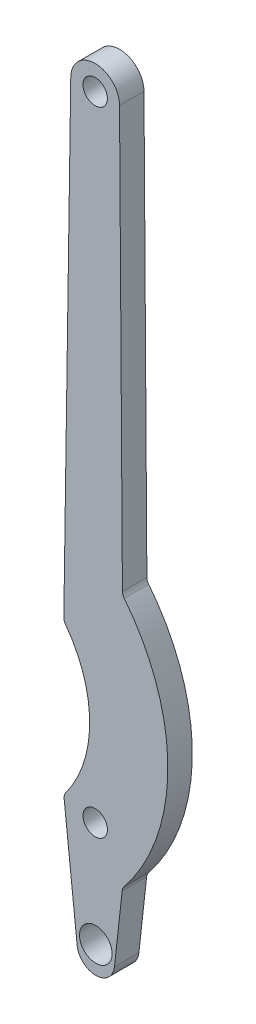
ISO-10303-21;
HEADER;
FILE_DESCRIPTION(('STEP AP214'),'2;1');
FILE_NAME('part.step','',(''),(''),'','','');
FILE_SCHEMA(('AUTOMOTIVE_DESIGN { 1 0 10303 214 1 1 1 1 }'));
ENDSEC;
DATA;
#1=APPLICATION_CONTEXT('core data for automotive mechanical design processes');
#2=APPLICATION_PROTOCOL_DEFINITION('international standard','automotive_design',2000,#1);
#3=PRODUCT_CONTEXT('',#1,'mechanical');
#4=PRODUCT('Part','Part','',(#3));
#5=PRODUCT_RELATED_PRODUCT_CATEGORY('part','',(#4));
#6=PRODUCT_DEFINITION_FORMATION('','',#4);
#7=PRODUCT_DEFINITION_CONTEXT('part definition',#1,'design');
#8=PRODUCT_DEFINITION('design','',#6,#7);
#9=PRODUCT_DEFINITION_SHAPE('','',#8);
#10=(LENGTH_UNIT() NAMED_UNIT(*) SI_UNIT(.MILLI.,.METRE.));
#11=(NAMED_UNIT(*) PLANE_ANGLE_UNIT() SI_UNIT($,.RADIAN.));
#12=(NAMED_UNIT(*) SI_UNIT($,.STERADIAN.) SOLID_ANGLE_UNIT());
#13=UNCERTAINTY_MEASURE_WITH_UNIT(LENGTH_MEASURE(1.E-05),#10,'distance_accuracy_value','');
#14=(GEOMETRIC_REPRESENTATION_CONTEXT(3) GLOBAL_UNCERTAINTY_ASSIGNED_CONTEXT((#13)) GLOBAL_UNIT_ASSIGNED_CONTEXT((#10,
#11,#12)) REPRESENTATION_CONTEXT('',''));
#15=CARTESIAN_POINT('',(0.,0.,0.));
#16=DIRECTION('',(0.,0.,1.));
#17=DIRECTION('',(1.,0.,0.));
#18=AXIS2_PLACEMENT_3D('',#15,#16,#17);
#19=CARTESIAN_POINT('',(-2.88963160667249,14.6637788753765,3.));
#20=DIRECTION('',(0.,0.,1.));
#21=DIRECTION('',(1.,0.,0.));
#22=AXIS2_PLACEMENT_3D('',#19,#20,#21);
#23=PLANE('',#22);
#24=CARTESIAN_POINT('',(-0.073800570580815,13.899599644221,3.));
#25=DIRECTION('',(0.,0.,1.));
#26=DIRECTION('',(1.,0.,0.));
#27=AXIS2_PLACEMENT_3D('',#24,#25,#26);
#28=CIRCLE('',#27,1.5);
#29=CARTESIAN_POINT('',(1.42619942941919,13.899599644221,3.));
#30=VERTEX_POINT('',#29);
#31=EDGE_CURVE('E288',#30,#30,#28,.T.);
#32=ORIENTED_EDGE('',*,*,#31,.F.);
#33=EDGE_LOOP('',(#32));
#34=FACE_BOUND('',#33,.T.);
#35=CARTESIAN_POINT('',(-2.88963160667249,14.6637788753765,3.));
#36=DIRECTION('',(0.,0.,1.));
#37=DIRECTION('',(1.,0.,0.));
#38=AXIS2_PLACEMENT_3D('',#35,#36,#37);
#39=CIRCLE('',#38,1.);
#40=CARTESIAN_POINT('',(-3.69322801783849,15.2589534782967,3.));
#41=VERTEX_POINT('',#40);
#42=CARTESIAN_POINT('',(-3.88386171590872,14.5565105674375,3.));
#43=VERTEX_POINT('',#42);
#44=EDGE_CURVE('E179',#41,#43,#39,.T.);
#45=ORIENTED_EDGE('',*,*,#44,.T.);
#46=DIRECTION('',(0.107268307939079,-0.994230109236231,0.));
#47=VECTOR('',#46,1.);
#48=CARTESIAN_POINT('',(-2.28672925124333,-0.246717108259881,3.));
#49=LINE('',#48,#47);
#50=CARTESIAN_POINT('',(-2.28672925124333,-0.246717108259881,3.));
#51=VERTEX_POINT('',#50);
#52=EDGE_CURVE('E107',#43,#51,#49,.T.);
#53=ORIENTED_EDGE('',*,*,#52,.T.);
#54=CARTESIAN_POINT('',(0.,0.,3.));
#55=DIRECTION('',(0.,0.,1.));
#56=DIRECTION('',(1.,0.,0.));
#57=AXIS2_PLACEMENT_3D('',#54,#55,#56);
#58=CIRCLE('',#57,2.3);
#59=CARTESIAN_POINT('',(2.28593295862145,-0.253989190101071,3.));
#60=VERTEX_POINT('',#59);
#61=EDGE_CURVE('E206',#51,#60,#58,.T.);
#62=ORIENTED_EDGE('',*,*,#61,.T.);
#63=DIRECTION('',(0.11043008265264,0.993883895052803,0.));
#64=VECTOR('',#63,1.);
#65=CARTESIAN_POINT('',(2.28593295862145,-0.253989190101071,3.));
#66=LINE('',#65,#64);
#67=CARTESIAN_POINT('',(3.23718165237959,8.30736233845027,3.));
#68=VERTEX_POINT('',#67);
#69=EDGE_CURVE('E225',#60,#68,#66,.T.);
#70=ORIENTED_EDGE('',*,*,#69,.T.);
#71=CARTESIAN_POINT('',(4.23106554743239,8.19693225579763,3.));
#72=DIRECTION('',(0.,0.,-1.));
#73=DIRECTION('',(1.,0.,0.));
#74=AXIS2_PLACEMENT_3D('',#71,#72,#73);
#75=CIRCLE('',#74,1.00000000000001);
#76=CARTESIAN_POINT('',(3.45033112153779,8.82179524575865,3.));
#77=VERTEX_POINT('',#76);
#78=EDGE_CURVE('E222',#68,#77,#75,.T.);
#79=ORIENTED_EDGE('',*,*,#78,.T.);
#80=CARTESIAN_POINT('',(-15.7471741853285,24.1865725220985,3.));
#81=DIRECTION('',(0.,0.,1.));
#82=DIRECTION('',(1.,0.,0.));
#83=AXIS2_PLACEMENT_3D('',#80,#81,#82);
#84=CIRCLE('',#83,24.5890339533437);
#85=CARTESIAN_POINT('',(3.48495827881477,39.5079847168125,3.));
#86=VERTEX_POINT('',#85);
#87=EDGE_CURVE('E224',#77,#86,#84,.T.);
#88=ORIENTED_EDGE('',*,*,#87,.T.);
#89=CARTESIAN_POINT('',(4.26710094048401,40.1310841124125,3.));
#90=DIRECTION('',(0.,0.,-1.));
#91=DIRECTION('',(1.,0.,0.));
#92=AXIS2_PLACEMENT_3D('',#89,#90,#91);
#93=CIRCLE('',#92,1.00000000000001);
#94=CARTESIAN_POINT('',(3.26712479890989,40.1241764150708,3.));
#95=VERTEX_POINT('',#94);
#96=EDGE_CURVE('E227',#86,#95,#93,.T.);
#97=ORIENTED_EDGE('',*,*,#96,.T.);
#98=DIRECTION('',(-0.00690769734163375,0.999976141574106,0.));
#99=VECTOR('',#98,1.);
#100=CARTESIAN_POINT('',(3.26712479890989,40.1241764150708,3.));
#101=LINE('',#100,#99);
#102=CARTESIAN_POINT('',(2.91166537517463,91.5814023839316,3.));
#103=VERTEX_POINT('',#102);
#104=EDGE_CURVE('E233',#95,#103,#101,.T.);
#105=ORIENTED_EDGE('',*,*,#104,.T.);
#106=CARTESIAN_POINT('',(-0.0791194399048102,91.5607424547017,3.));
#107=DIRECTION('',(0.,0.,1.));
#108=DIRECTION('',(1.,0.,0.));
#109=AXIS2_PLACEMENT_3D('',#106,#107,#108);
#110=CIRCLE('',#109,2.99085617219978);
#111=CARTESIAN_POINT('',(-3.06965130583689,91.6047856338595,3.));
#112=VERTEX_POINT('',#111);
#113=EDGE_CURVE('E138',#103,#112,#110,.T.);
#114=ORIENTED_EDGE('',*,*,#113,.T.);
#115=DIRECTION('',(-0.0147259435499138,-0.99989156741447,0.));
#116=VECTOR('',#115,1.);
#117=CARTESIAN_POINT('',(-3.92145874370195,33.7670605811119,3.));
#118=LINE('',#117,#116);
#119=CARTESIAN_POINT('',(-3.92145874370195,33.7670605811119,3.));
#120=VERTEX_POINT('',#119);
#121=EDGE_CURVE('E132',#112,#120,#118,.T.);
#122=ORIENTED_EDGE('',*,*,#121,.T.);
#123=CARTESIAN_POINT('',(-2.92156717628748,33.752334637562,3.));
#124=DIRECTION('',(0.,0.,1.));
#125=DIRECTION('',(1.,0.,0.));
#126=AXIS2_PLACEMENT_3D('',#123,#124,#125);
#127=CIRCLE('',#126,1.);
#128=CARTESIAN_POINT('',(-3.72316761435255,33.1544745053455,3.));
#129=VERTEX_POINT('',#128);
#130=EDGE_CURVE('E136',#120,#129,#127,.T.);
#131=ORIENTED_EDGE('',*,*,#130,.T.);
#132=CARTESIAN_POINT('',(-15.7471741853285,24.1865725220985,3.));
#133=DIRECTION('',(0.,0.,-1.));
#134=DIRECTION('',(1.,0.,0.));
#135=AXIS2_PLACEMENT_3D('',#132,#133,#134);
#136=CIRCLE('',#135,15.);
#137=EDGE_CURVE('E52',#129,#41,#136,.T.);
#138=ORIENTED_EDGE('',*,*,#137,.T.);
#139=EDGE_LOOP('',(#45,#53,#62,#70,#79,#88,#97,#105,#114,#122,#131,#138));
#140=FACE_BOUND('',#139,.T.);
#141=CARTESIAN_POINT('',(-0.0791194399048102,91.5607424547017,3.));
#142=DIRECTION('',(0.,0.,1.));
#143=DIRECTION('',(1.,0.,0.));
#144=AXIS2_PLACEMENT_3D('',#141,#142,#143);
#145=CIRCLE('',#144,1.5);
#146=CARTESIAN_POINT('',(1.42088056009519,91.5607424547017,3.));
#147=VERTEX_POINT('',#146);
#148=EDGE_CURVE('E160',#147,#147,#145,.T.);
#149=ORIENTED_EDGE('',*,*,#148,.F.);
#150=EDGE_LOOP('',(#149));
#151=FACE_BOUND('',#150,.T.);
#152=CARTESIAN_POINT('',(0.,1.,3.));
#153=DIRECTION('',(0.,0.,1.));
#154=DIRECTION('',(1.,0.,0.));
#155=AXIS2_PLACEMENT_3D('',#152,#153,#154);
#156=CIRCLE('',#155,2.);
#157=CARTESIAN_POINT('',(2.,1.,3.));
#158=VERTEX_POINT('',#157);
#159=EDGE_CURVE('E279',#158,#158,#156,.T.);
#160=ORIENTED_EDGE('',*,*,#159,.F.);
#161=EDGE_LOOP('',(#160));
#162=FACE_BOUND('',#161,.T.);
#163=ADVANCED_FACE('F35',(#34,#140,#151,#162),#23,.T.);
#164=CARTESIAN_POINT('',(-2.88963160667249,14.6637788753765,0.));
#165=DIRECTION('',(0.,0.,1.));
#166=DIRECTION('',(1.,0.,0.));
#167=AXIS2_PLACEMENT_3D('',#164,#165,#166);
#168=PLANE('',#167);
#169=CARTESIAN_POINT('',(-2.88963160667249,14.6637788753765,0.));
#170=DIRECTION('',(0.,0.,1.));
#171=DIRECTION('',(1.,0.,0.));
#172=AXIS2_PLACEMENT_3D('',#169,#170,#171);
#173=CIRCLE('',#172,1.);
#174=CARTESIAN_POINT('',(-3.69322801783849,15.2589534782967,0.));
#175=VERTEX_POINT('',#174);
#176=CARTESIAN_POINT('',(-3.88386171590872,14.5565105674375,0.));
#177=VERTEX_POINT('',#176);
#178=EDGE_CURVE('E156',#175,#177,#173,.T.);
#179=ORIENTED_EDGE('',*,*,#178,.F.);
#180=CARTESIAN_POINT('',(-15.7471741853285,24.1865725220985,0.));
#181=DIRECTION('',(0.,0.,-1.));
#182=DIRECTION('',(1.,0.,0.));
#183=AXIS2_PLACEMENT_3D('',#180,#181,#182);
#184=CIRCLE('',#183,15.);
#185=CARTESIAN_POINT('',(-3.72316761435255,33.1544745053455,0.));
#186=VERTEX_POINT('',#185);
#187=EDGE_CURVE('E99',#186,#175,#184,.T.);
#188=ORIENTED_EDGE('',*,*,#187,.F.);
#189=CARTESIAN_POINT('',(-2.92156717628748,33.752334637562,0.));
#190=DIRECTION('',(0.,0.,1.));
#191=DIRECTION('',(1.,0.,0.));
#192=AXIS2_PLACEMENT_3D('',#189,#190,#191);
#193=CIRCLE('',#192,1.);
#194=CARTESIAN_POINT('',(-3.92145874370195,33.7670605811119,0.));
#195=VERTEX_POINT('',#194);
#196=EDGE_CURVE('E93',#195,#186,#193,.T.);
#197=ORIENTED_EDGE('',*,*,#196,.F.);
#198=DIRECTION('',(-0.0147259435499138,-0.99989156741447,0.));
#199=VECTOR('',#198,1.);
#200=CARTESIAN_POINT('',(-3.92145874370195,33.7670605811119,0.));
#201=LINE('',#200,#199);
#202=CARTESIAN_POINT('',(-3.06965130583689,91.6047856338595,0.));
#203=VERTEX_POINT('',#202);
#204=EDGE_CURVE('E146',#203,#195,#201,.T.);
#205=ORIENTED_EDGE('',*,*,#204,.F.);
#206=CARTESIAN_POINT('',(-0.0791194399048102,91.5607424547017,0.));
#207=DIRECTION('',(0.,0.,1.));
#208=DIRECTION('',(1.,0.,0.));
#209=AXIS2_PLACEMENT_3D('',#206,#207,#208);
#210=CIRCLE('',#209,2.99085617219978);
#211=CARTESIAN_POINT('',(2.91166537517463,91.5814023839316,0.));
#212=VERTEX_POINT('',#211);
#213=EDGE_CURVE('E174',#212,#203,#210,.T.);
#214=ORIENTED_EDGE('',*,*,#213,.F.);
#215=DIRECTION('',(-0.00690769734163375,0.999976141574106,0.));
#216=VECTOR('',#215,1.);
#217=CARTESIAN_POINT('',(3.26712479890989,40.1241764150708,0.));
#218=LINE('',#217,#216);
#219=CARTESIAN_POINT('',(3.26712479890989,40.1241764150708,0.));
#220=VERTEX_POINT('',#219);
#221=EDGE_CURVE('E172',#220,#212,#218,.T.);
#222=ORIENTED_EDGE('',*,*,#221,.F.);
#223=CARTESIAN_POINT('',(4.26710094048401,40.1310841124125,0.));
#224=DIRECTION('',(0.,0.,-1.));
#225=DIRECTION('',(1.,0.,0.));
#226=AXIS2_PLACEMENT_3D('',#223,#224,#225);
#227=CIRCLE('',#226,1.00000000000001);
#228=CARTESIAN_POINT('',(3.48495827881477,39.5079847168125,0.));
#229=VERTEX_POINT('',#228);
#230=EDGE_CURVE('E170',#229,#220,#227,.T.);
#231=ORIENTED_EDGE('',*,*,#230,.F.);
#232=CARTESIAN_POINT('',(-15.7471741853285,24.1865725220985,0.));
#233=DIRECTION('',(0.,0.,1.));
#234=DIRECTION('',(1.,0.,0.));
#235=AXIS2_PLACEMENT_3D('',#232,#233,#234);
#236=CIRCLE('',#235,24.5890339533437);
#237=CARTESIAN_POINT('',(3.45033112153779,8.82179524575865,0.));
#238=VERTEX_POINT('',#237);
#239=EDGE_CURVE('E168',#238,#229,#236,.T.);
#240=ORIENTED_EDGE('',*,*,#239,.F.);
#241=CARTESIAN_POINT('',(4.23106554743239,8.19693225579763,0.));
#242=DIRECTION('',(0.,0.,-1.));
#243=DIRECTION('',(1.,0.,0.));
#244=AXIS2_PLACEMENT_3D('',#241,#242,#243);
#245=CIRCLE('',#244,1.00000000000001);
#246=CARTESIAN_POINT('',(3.23718165237959,8.30736233845027,0.));
#247=VERTEX_POINT('',#246);
#248=EDGE_CURVE('E166',#247,#238,#245,.T.);
#249=ORIENTED_EDGE('',*,*,#248,.F.);
#250=DIRECTION('',(0.11043008265264,0.993883895052803,0.));
#251=VECTOR('',#250,1.);
#252=CARTESIAN_POINT('',(2.28593295862145,-0.253989190101071,0.));
#253=LINE('',#252,#251);
#254=CARTESIAN_POINT('',(2.28593295862145,-0.253989190101071,0.));
#255=VERTEX_POINT('',#254);
#256=EDGE_CURVE('E164',#255,#247,#253,.T.);
#257=ORIENTED_EDGE('',*,*,#256,.F.);
#258=CARTESIAN_POINT('',(0.,0.,0.));
#259=DIRECTION('',(0.,0.,1.));
#260=DIRECTION('',(1.,0.,0.));
#261=AXIS2_PLACEMENT_3D('',#258,#259,#260);
#262=CIRCLE('',#261,2.3);
#263=CARTESIAN_POINT('',(-2.28672925124333,-0.246717108259881,0.));
#264=VERTEX_POINT('',#263);
#265=EDGE_CURVE('E162',#264,#255,#262,.T.);
#266=ORIENTED_EDGE('',*,*,#265,.F.);
#267=DIRECTION('',(0.107268307939079,-0.994230109236231,0.));
#268=VECTOR('',#267,1.);
#269=CARTESIAN_POINT('',(-2.28672925124333,-0.246717108259881,0.));
#270=LINE('',#269,#268);
#271=EDGE_CURVE('E159',#177,#264,#270,.T.);
#272=ORIENTED_EDGE('',*,*,#271,.F.);
#273=EDGE_LOOP('',(#179,#188,#197,#205,#214,#222,#231,#240,#249,#257,#266,#272));
#274=FACE_BOUND('',#273,.T.);
#275=CARTESIAN_POINT('',(-0.0791194399048102,91.5607424547017,0.));
#276=DIRECTION('',(0.,0.,1.));
#277=DIRECTION('',(1.,0.,0.));
#278=AXIS2_PLACEMENT_3D('',#275,#276,#277);
#279=CIRCLE('',#278,1.5);
#280=CARTESIAN_POINT('',(1.42088056009519,91.5607424547017,0.));
#281=VERTEX_POINT('',#280);
#282=EDGE_CURVE('E291',#281,#281,#279,.T.);
#283=ORIENTED_EDGE('',*,*,#282,.T.);
#284=EDGE_LOOP('',(#283));
#285=FACE_BOUND('',#284,.T.);
#286=CARTESIAN_POINT('',(-0.073800570580815,13.899599644221,0.));
#287=DIRECTION('',(0.,0.,1.));
#288=DIRECTION('',(1.,0.,0.));
#289=AXIS2_PLACEMENT_3D('',#286,#287,#288);
#290=CIRCLE('',#289,1.5);
#291=CARTESIAN_POINT('',(1.42619942941919,13.899599644221,0.));
#292=VERTEX_POINT('',#291);
#293=EDGE_CURVE('E285',#292,#292,#290,.T.);
#294=ORIENTED_EDGE('',*,*,#293,.T.);
#295=EDGE_LOOP('',(#294));
#296=FACE_BOUND('',#295,.T.);
#297=CARTESIAN_POINT('',(0.,1.,0.));
#298=DIRECTION('',(0.,0.,1.));
#299=DIRECTION('',(1.,0.,0.));
#300=AXIS2_PLACEMENT_3D('',#297,#298,#299);
#301=CIRCLE('',#300,2.);
#302=CARTESIAN_POINT('',(2.,1.,0.));
#303=VERTEX_POINT('',#302);
#304=EDGE_CURVE('E282',#303,#303,#301,.T.);
#305=ORIENTED_EDGE('',*,*,#304,.T.);
#306=EDGE_LOOP('',(#305));
#307=FACE_BOUND('',#306,.T.);
#308=ADVANCED_FACE('F210',(#274,#285,#296,#307),#168,.F.);
#309=CARTESIAN_POINT('',(-2.88963160667249,14.6637788753765,3.));
#310=DIRECTION('',(0.,0.,-1.));
#311=DIRECTION('',(-1.,0.,0.));
#312=AXIS2_PLACEMENT_3D('',#309,#310,#311);
#313=CYLINDRICAL_SURFACE('',#312,1.);
#314=ORIENTED_EDGE('',*,*,#178,.T.);
#315=DIRECTION('',(0.,0.,-1.));
#316=VECTOR('',#315,1.);
#317=CARTESIAN_POINT('',(-3.88386171590872,14.5565105674375,3.));
#318=LINE('',#317,#316);
#319=EDGE_CURVE('E11',#43,#177,#318,.T.);
#320=ORIENTED_EDGE('',*,*,#319,.F.);
#321=ORIENTED_EDGE('',*,*,#44,.F.);
#322=DIRECTION('',(0.,0.,-1.));
#323=VECTOR('',#322,1.);
#324=CARTESIAN_POINT('',(-3.69322801783849,15.2589534782967,3.));
#325=LINE('',#324,#323);
#326=EDGE_CURVE('E152',#41,#175,#325,.T.);
#327=ORIENTED_EDGE('',*,*,#326,.T.);
#328=EDGE_LOOP('',(#314,#320,#321,#327));
#329=FACE_BOUND('',#328,.T.);
#330=ADVANCED_FACE('F37',(#329),#313,.T.);
#331=CARTESIAN_POINT('',(-2.28672925124333,-0.246717108259881,3.));
#332=DIRECTION('',(0.994230109236231,0.107268307939079,0.));
#333=DIRECTION('',(-0.107268307939079,0.994230109236231,0.));
#334=AXIS2_PLACEMENT_3D('',#331,#332,#333);
#335=PLANE('',#334);
#336=ORIENTED_EDGE('',*,*,#271,.T.);
#337=DIRECTION('',(0.,0.,-1.));
#338=VECTOR('',#337,1.);
#339=CARTESIAN_POINT('',(-2.28672925124333,-0.246717108259881,3.));
#340=LINE('',#339,#338);
#341=EDGE_CURVE('E44',#51,#264,#340,.T.);
#342=ORIENTED_EDGE('',*,*,#341,.F.);
#343=ORIENTED_EDGE('',*,*,#52,.F.);
#344=ORIENTED_EDGE('',*,*,#319,.T.);
#345=EDGE_LOOP('',(#336,#342,#343,#344));
#346=FACE_BOUND('',#345,.T.);
#347=ADVANCED_FACE('F393',(#346),#335,.F.);
#348=CARTESIAN_POINT('',(0.,0.,3.));
#349=DIRECTION('',(0.,0.,-1.));
#350=DIRECTION('',(-1.,0.,0.));
#351=AXIS2_PLACEMENT_3D('',#348,#349,#350);
#352=CYLINDRICAL_SURFACE('',#351,2.3);
#353=ORIENTED_EDGE('',*,*,#265,.T.);
#354=DIRECTION('',(0.,0.,-1.));
#355=VECTOR('',#354,1.);
#356=CARTESIAN_POINT('',(2.28593295862145,-0.253989190101071,3.));
#357=LINE('',#356,#355);
#358=EDGE_CURVE('E198',#60,#255,#357,.T.);
#359=ORIENTED_EDGE('',*,*,#358,.F.);
#360=ORIENTED_EDGE('',*,*,#61,.F.);
#361=ORIENTED_EDGE('',*,*,#341,.T.);
#362=EDGE_LOOP('',(#353,#359,#360,#361));
#363=FACE_BOUND('',#362,.T.);
#364=ADVANCED_FACE('F204',(#363),#352,.T.);
#365=CARTESIAN_POINT('',(2.28593295862145,-0.253989190101071,3.));
#366=DIRECTION('',(-0.993883895052803,0.11043008265264,0.));
#367=DIRECTION('',(-0.11043008265264,-0.993883895052803,0.));
#368=AXIS2_PLACEMENT_3D('',#365,#366,#367);
#369=PLANE('',#368);
#370=ORIENTED_EDGE('',*,*,#256,.T.);
#371=DIRECTION('',(0.,0.,-1.));
#372=VECTOR('',#371,1.);
#373=CARTESIAN_POINT('',(3.23718165237959,8.30736233845027,3.));
#374=LINE('',#373,#372);
#375=EDGE_CURVE('E195',#68,#247,#374,.T.);
#376=ORIENTED_EDGE('',*,*,#375,.F.);
#377=ORIENTED_EDGE('',*,*,#69,.F.);
#378=ORIENTED_EDGE('',*,*,#358,.T.);
#379=EDGE_LOOP('',(#370,#376,#377,#378));
#380=FACE_BOUND('',#379,.T.);
#381=ADVANCED_FACE('F216',(#380),#369,.F.);
#382=CARTESIAN_POINT('',(4.23106554743239,8.19693225579763,3.));
#383=DIRECTION('',(0.,0.,-1.));
#384=DIRECTION('',(-1.,0.,0.));
#385=AXIS2_PLACEMENT_3D('',#382,#383,#384);
#386=CYLINDRICAL_SURFACE('',#385,1.00000000000001);
#387=ORIENTED_EDGE('',*,*,#248,.T.);
#388=DIRECTION('',(0.,0.,-1.));
#389=VECTOR('',#388,1.);
#390=CARTESIAN_POINT('',(3.45033112153779,8.82179524575865,3.));
#391=LINE('',#390,#389);
#392=EDGE_CURVE('E192',#77,#238,#391,.T.);
#393=ORIENTED_EDGE('',*,*,#392,.F.);
#394=ORIENTED_EDGE('',*,*,#78,.F.);
#395=ORIENTED_EDGE('',*,*,#375,.T.);
#396=EDGE_LOOP('',(#387,#393,#394,#395));
#397=FACE_BOUND('',#396,.T.);
#398=ADVANCED_FACE('F220',(#397),#386,.F.);
#399=CARTESIAN_POINT('',(-15.7471741853285,24.1865725220985,3.));
#400=DIRECTION('',(0.,0.,-1.));
#401=DIRECTION('',(-1.,0.,0.));
#402=AXIS2_PLACEMENT_3D('',#399,#400,#401);
#403=CYLINDRICAL_SURFACE('',#402,24.5890339533437);
#404=ORIENTED_EDGE('',*,*,#239,.T.);
#405=DIRECTION('',(0.,0.,-1.));
#406=VECTOR('',#405,1.);
#407=CARTESIAN_POINT('',(3.48495827881477,39.5079847168125,3.));
#408=LINE('',#407,#406);
#409=EDGE_CURVE('E189',#86,#229,#408,.T.);
#410=ORIENTED_EDGE('',*,*,#409,.F.);
#411=ORIENTED_EDGE('',*,*,#87,.F.);
#412=ORIENTED_EDGE('',*,*,#392,.T.);
#413=EDGE_LOOP('',(#404,#410,#411,#412));
#414=FACE_BOUND('',#413,.T.);
#415=ADVANCED_FACE('F358',(#414),#403,.T.);
#416=CARTESIAN_POINT('',(4.26710094048401,40.1310841124125,3.));
#417=DIRECTION('',(0.,0.,-1.));
#418=DIRECTION('',(-1.,0.,0.));
#419=AXIS2_PLACEMENT_3D('',#416,#417,#418);
#420=CYLINDRICAL_SURFACE('',#419,1.00000000000001);
#421=ORIENTED_EDGE('',*,*,#230,.T.);
#422=DIRECTION('',(0.,0.,-1.));
#423=VECTOR('',#422,1.);
#424=CARTESIAN_POINT('',(3.26712479890989,40.1241764150708,3.));
#425=LINE('',#424,#423);
#426=EDGE_CURVE('E186',#95,#220,#425,.T.);
#427=ORIENTED_EDGE('',*,*,#426,.F.);
#428=ORIENTED_EDGE('',*,*,#96,.F.);
#429=ORIENTED_EDGE('',*,*,#409,.T.);
#430=EDGE_LOOP('',(#421,#427,#428,#429));
#431=FACE_BOUND('',#430,.T.);
#432=ADVANCED_FACE('F349',(#431),#420,.F.);
#433=CARTESIAN_POINT('',(3.26712479890989,40.1241764150708,3.));
#434=DIRECTION('',(-0.999976141574106,-0.00690769734163375,0.));
#435=DIRECTION('',(0.00690769734163375,-0.999976141574106,0.));
#436=AXIS2_PLACEMENT_3D('',#433,#434,#435);
#437=PLANE('',#436);
#438=ORIENTED_EDGE('',*,*,#221,.T.);
#439=DIRECTION('',(0.,0.,-1.));
#440=VECTOR('',#439,1.);
#441=CARTESIAN_POINT('',(2.91166537517463,91.5814023839316,3.));
#442=LINE('',#441,#440);
#443=EDGE_CURVE('E183',#103,#212,#442,.T.);
#444=ORIENTED_EDGE('',*,*,#443,.F.);
#445=ORIENTED_EDGE('',*,*,#104,.F.);
#446=ORIENTED_EDGE('',*,*,#426,.T.);
#447=EDGE_LOOP('',(#438,#444,#445,#446));
#448=FACE_BOUND('',#447,.T.);
#449=ADVANCED_FACE('F239',(#448),#437,.F.);
#450=CARTESIAN_POINT('',(-0.0791194399048102,91.5607424547017,3.));
#451=DIRECTION('',(0.,0.,-1.));
#452=DIRECTION('',(-1.,0.,0.));
#453=AXIS2_PLACEMENT_3D('',#450,#451,#452);
#454=CYLINDRICAL_SURFACE('',#453,2.99085617219978);
#455=ORIENTED_EDGE('',*,*,#213,.T.);
#456=DIRECTION('',(0.,0.,-1.));
#457=VECTOR('',#456,1.);
#458=CARTESIAN_POINT('',(-3.06965130583689,91.6047856338595,3.));
#459=LINE('',#458,#457);
#460=EDGE_CURVE('E147',#112,#203,#459,.T.);
#461=ORIENTED_EDGE('',*,*,#460,.F.);
#462=ORIENTED_EDGE('',*,*,#113,.F.);
#463=ORIENTED_EDGE('',*,*,#443,.T.);
#464=EDGE_LOOP('',(#455,#461,#462,#463));
#465=FACE_BOUND('',#464,.T.);
#466=ADVANCED_FACE('F243',(#465),#454,.T.);
#467=CARTESIAN_POINT('',(-3.92145874370195,33.7670605811119,3.));
#468=DIRECTION('',(0.999891567414469,-0.0147259435499138,0.));
#469=DIRECTION('',(0.0147259435499138,0.99989156741447,0.));
#470=AXIS2_PLACEMENT_3D('',#467,#468,#469);
#471=PLANE('',#470);
#472=ORIENTED_EDGE('',*,*,#204,.T.);
#473=DIRECTION('',(0.,0.,-1.));
#474=VECTOR('',#473,1.);
#475=CARTESIAN_POINT('',(-3.92145874370195,33.7670605811119,3.));
#476=LINE('',#475,#474);
#477=EDGE_CURVE('E143',#120,#195,#476,.T.);
#478=ORIENTED_EDGE('',*,*,#477,.F.);
#479=ORIENTED_EDGE('',*,*,#121,.F.);
#480=ORIENTED_EDGE('',*,*,#460,.T.);
#481=EDGE_LOOP('',(#472,#478,#479,#480));
#482=FACE_BOUND('',#481,.T.);
#483=ADVANCED_FACE('F144',(#482),#471,.F.);
#484=CARTESIAN_POINT('',(-2.92156717628748,33.752334637562,3.));
#485=DIRECTION('',(0.,0.,-1.));
#486=DIRECTION('',(-1.,0.,0.));
#487=AXIS2_PLACEMENT_3D('',#484,#485,#486);
#488=CYLINDRICAL_SURFACE('',#487,1.);
#489=ORIENTED_EDGE('',*,*,#196,.T.);
#490=DIRECTION('',(0.,0.,-1.));
#491=VECTOR('',#490,1.);
#492=CARTESIAN_POINT('',(-3.72316761435255,33.1544745053455,3.));
#493=LINE('',#492,#491);
#494=EDGE_CURVE('E148',#129,#186,#493,.T.);
#495=ORIENTED_EDGE('',*,*,#494,.F.);
#496=ORIENTED_EDGE('',*,*,#130,.F.);
#497=ORIENTED_EDGE('',*,*,#477,.T.);
#498=EDGE_LOOP('',(#489,#495,#496,#497));
#499=FACE_BOUND('',#498,.T.);
#500=ADVANCED_FACE('F150',(#499),#488,.T.);
#501=CARTESIAN_POINT('',(-15.7471741853285,24.1865725220985,3.));
#502=DIRECTION('',(0.,0.,-1.));
#503=DIRECTION('',(-1.,0.,0.));
#504=AXIS2_PLACEMENT_3D('',#501,#502,#503);
#505=CYLINDRICAL_SURFACE('',#504,15.);
#506=ORIENTED_EDGE('',*,*,#187,.T.);
#507=ORIENTED_EDGE('',*,*,#326,.F.);
#508=ORIENTED_EDGE('',*,*,#137,.F.);
#509=ORIENTED_EDGE('',*,*,#494,.T.);
#510=EDGE_LOOP('',(#506,#507,#508,#509));
#511=FACE_BOUND('',#510,.T.);
#512=ADVANCED_FACE('F247',(#511),#505,.F.);
#513=CARTESIAN_POINT('',(-0.0791194399048102,91.5607424547017,3.));
#514=DIRECTION('',(0.,0.,-1.));
#515=DIRECTION('',(-1.,0.,0.));
#516=AXIS2_PLACEMENT_3D('',#513,#514,#515);
#517=CYLINDRICAL_SURFACE('',#516,1.5);
#518=ORIENTED_EDGE('',*,*,#148,.T.);
#519=EDGE_LOOP('',(#518));
#520=FACE_BOUND('',#519,.T.);
#521=ORIENTED_EDGE('',*,*,#282,.F.);
#522=EDGE_LOOP('',(#521));
#523=FACE_BOUND('',#522,.T.);
#524=ADVANCED_FACE('F249',(#520,#523),#517,.F.);
#525=CARTESIAN_POINT('',(-0.073800570580815,13.899599644221,3.));
#526=DIRECTION('',(0.,0.,-1.));
#527=DIRECTION('',(-1.,0.,0.));
#528=AXIS2_PLACEMENT_3D('',#525,#526,#527);
#529=CYLINDRICAL_SURFACE('',#528,1.5);
#530=ORIENTED_EDGE('',*,*,#31,.T.);
#531=EDGE_LOOP('',(#530));
#532=FACE_BOUND('',#531,.T.);
#533=ORIENTED_EDGE('',*,*,#293,.F.);
#534=EDGE_LOOP('',(#533));
#535=FACE_BOUND('',#534,.T.);
#536=ADVANCED_FACE('F255',(#532,#535),#529,.F.);
#537=CARTESIAN_POINT('',(0.,1.,3.));
#538=DIRECTION('',(0.,0.,-1.));
#539=DIRECTION('',(-1.,0.,0.));
#540=AXIS2_PLACEMENT_3D('',#537,#538,#539);
#541=CYLINDRICAL_SURFACE('',#540,2.);
#542=ORIENTED_EDGE('',*,*,#159,.T.);
#543=EDGE_LOOP('',(#542));
#544=FACE_BOUND('',#543,.T.);
#545=ORIENTED_EDGE('',*,*,#304,.F.);
#546=EDGE_LOOP('',(#545));
#547=FACE_BOUND('',#546,.T.);
#548=ADVANCED_FACE('F270',(#544,#547),#541,.F.);
#549=CLOSED_SHELL('',(#163,#308,#330,#347,#364,#381,#398,#415,#432,#449,#466,#483,#500,#512,
#524,#536,#548));
#550=MANIFOLD_SOLID_BREP('B2',#549);
#551=ADVANCED_BREP_SHAPE_REPRESENTATION('',(#18,#550),#14);
#552=SHAPE_DEFINITION_REPRESENTATION(#9,#551);
ENDSEC;
END-ISO-10303-21;
